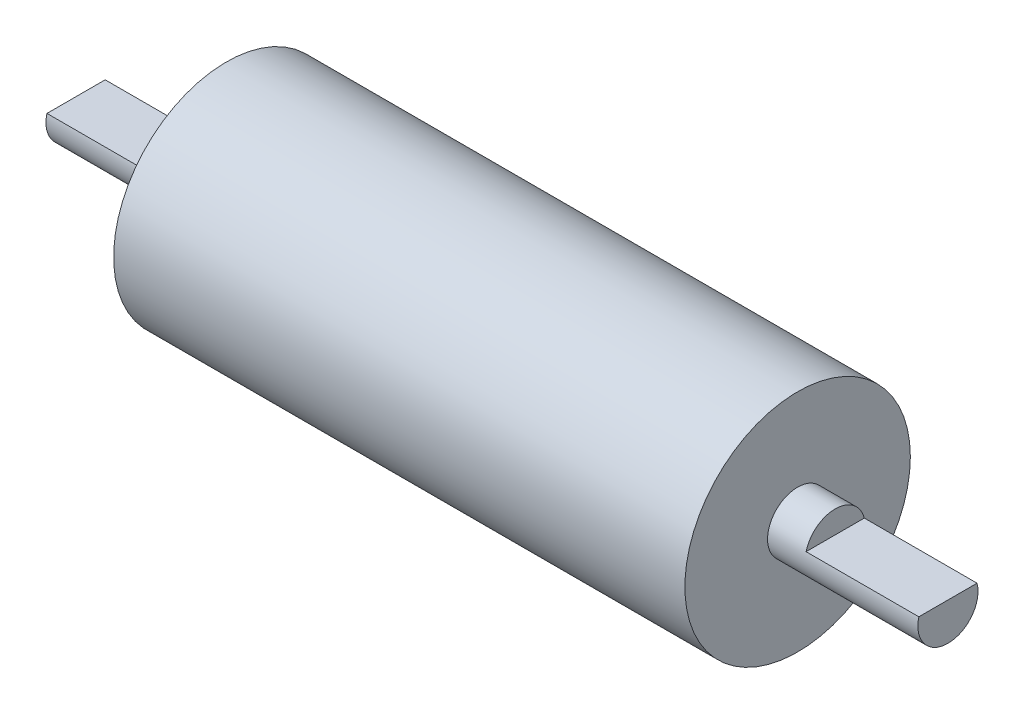
ISO-10303-21;
HEADER;
FILE_DESCRIPTION(('STEP AP214'),'2;1');
FILE_NAME('part.step','',(''),(''),'','','');
FILE_SCHEMA(('AUTOMOTIVE_DESIGN { 1 0 10303 214 1 1 1 1 }'));
ENDSEC;
DATA;
#1=APPLICATION_CONTEXT('core data for automotive mechanical design processes');
#2=APPLICATION_PROTOCOL_DEFINITION('international standard','automotive_design',2000,#1);
#3=PRODUCT_CONTEXT('',#1,'mechanical');
#4=PRODUCT('Part','Part','',(#3));
#5=PRODUCT_RELATED_PRODUCT_CATEGORY('part','',(#4));
#6=PRODUCT_DEFINITION_FORMATION('','',#4);
#7=PRODUCT_DEFINITION_CONTEXT('part definition',#1,'design');
#8=PRODUCT_DEFINITION('design','',#6,#7);
#9=PRODUCT_DEFINITION_SHAPE('','',#8);
#10=(LENGTH_UNIT() NAMED_UNIT(*) SI_UNIT(.MILLI.,.METRE.));
#11=(NAMED_UNIT(*) PLANE_ANGLE_UNIT() SI_UNIT($,.RADIAN.));
#12=(NAMED_UNIT(*) SI_UNIT($,.STERADIAN.) SOLID_ANGLE_UNIT());
#13=UNCERTAINTY_MEASURE_WITH_UNIT(LENGTH_MEASURE(1.E-05),#10,'distance_accuracy_value','');
#14=(GEOMETRIC_REPRESENTATION_CONTEXT(3) GLOBAL_UNCERTAINTY_ASSIGNED_CONTEXT((#13)) GLOBAL_UNIT_ASSIGNED_CONTEXT((#10,
#11,#12)) REPRESENTATION_CONTEXT('',''));
#15=CARTESIAN_POINT('',(0.,0.,0.));
#16=DIRECTION('',(0.,0.,1.));
#17=DIRECTION('',(1.,0.,0.));
#18=AXIS2_PLACEMENT_3D('',#15,#16,#17);
#19=CARTESIAN_POINT('',(20.,0.,0.));
#20=DIRECTION('',(-1.,0.,0.));
#21=DIRECTION('',(0.,0.,1.));
#22=AXIS2_PLACEMENT_3D('',#19,#20,#21);
#23=CYLINDRICAL_SURFACE('',#22,4.);
#24=CARTESIAN_POINT('',(20.,0.,0.));
#25=DIRECTION('',(1.,0.,0.));
#26=DIRECTION('',(0.,0.,-1.));
#27=AXIS2_PLACEMENT_3D('',#24,#25,#26);
#28=CIRCLE('',#27,4.);
#29=CARTESIAN_POINT('',(20.,0.,-4.));
#30=VERTEX_POINT('',#29);
#31=EDGE_CURVE('E105',#30,#30,#28,.T.);
#32=ORIENTED_EDGE('',*,*,#31,.F.);
#33=EDGE_LOOP('',(#32));
#34=FACE_BOUND('',#33,.T.);
#35=CARTESIAN_POINT('',(15.,0.,0.));
#36=DIRECTION('',(-1.,0.,0.));
#37=DIRECTION('',(0.,0.,1.));
#38=AXIS2_PLACEMENT_3D('',#35,#36,#37);
#39=CIRCLE('',#38,4.);
#40=CARTESIAN_POINT('',(15.,1.,3.87298334620742));
#41=VERTEX_POINT('',#40);
#42=CARTESIAN_POINT('',(15.,1.,-3.87298334620742));
#43=VERTEX_POINT('',#42);
#44=EDGE_CURVE('E83',#41,#43,#39,.T.);
#45=ORIENTED_EDGE('',*,*,#44,.F.);
#46=DIRECTION('',(-1.,0.,0.));
#47=VECTOR('',#46,1.);
#48=CARTESIAN_POINT('',(20.,1.,3.87298334620742));
#49=LINE('',#48,#47);
#50=CARTESIAN_POINT('',(0.,1.,3.87298334620741));
#51=VERTEX_POINT('',#50);
#52=EDGE_CURVE('E92',#41,#51,#49,.T.);
#53=ORIENTED_EDGE('',*,*,#52,.T.);
#54=CARTESIAN_POINT('',(0.,0.,0.));
#55=DIRECTION('',(1.,0.,0.));
#56=DIRECTION('',(0.,0.,-1.));
#57=AXIS2_PLACEMENT_3D('',#54,#55,#56);
#58=CIRCLE('',#57,4.);
#59=CARTESIAN_POINT('',(0.,1.,-3.87298334620742));
#60=VERTEX_POINT('',#59);
#61=EDGE_CURVE('E107',#51,#60,#58,.T.);
#62=ORIENTED_EDGE('',*,*,#61,.T.);
#63=DIRECTION('',(-1.,0.,0.));
#64=VECTOR('',#63,1.);
#65=CARTESIAN_POINT('',(20.,1.,-3.87298334620742));
#66=LINE('',#65,#64);
#67=EDGE_CURVE('E59',#60,#43,#66,.F.);
#68=ORIENTED_EDGE('',*,*,#67,.T.);
#69=EDGE_LOOP('',(#45,#53,#62,#68));
#70=FACE_BOUND('',#69,.T.);
#71=ADVANCED_FACE('F37',(#34,#70),#23,.T.);
#72=CARTESIAN_POINT('',(0.,0.,0.));
#73=DIRECTION('',(1.,0.,0.));
#74=DIRECTION('',(0.,0.,-1.));
#75=AXIS2_PLACEMENT_3D('',#72,#73,#74);
#76=PLANE('',#75);
#77=ORIENTED_EDGE('',*,*,#61,.F.);
#78=DIRECTION('',(0.,0.,-1.));
#79=VECTOR('',#78,1.);
#80=CARTESIAN_POINT('',(0.,1.,0.));
#81=LINE('',#80,#79);
#82=EDGE_CURVE('E104',#51,#60,#81,.T.);
#83=ORIENTED_EDGE('',*,*,#82,.T.);
#84=EDGE_LOOP('',(#77,#83));
#85=FACE_BOUND('',#84,.T.);
#86=ADVANCED_FACE('F136',(#85),#76,.F.);
#87=CARTESIAN_POINT('',(96.,0.,0.));
#88=DIRECTION('',(-1.,0.,0.));
#89=DIRECTION('',(0.,0.,1.));
#90=AXIS2_PLACEMENT_3D('',#87,#88,#89);
#91=CYLINDRICAL_SURFACE('',#90,15.);
#92=CARTESIAN_POINT('',(96.,0.,0.));
#93=DIRECTION('',(1.,0.,0.));
#94=DIRECTION('',(0.,0.,-1.));
#95=AXIS2_PLACEMENT_3D('',#92,#93,#94);
#96=CIRCLE('',#95,15.);
#97=CARTESIAN_POINT('',(96.,0.,-15.));
#98=VERTEX_POINT('',#97);
#99=EDGE_CURVE('E95',#98,#98,#96,.T.);
#100=ORIENTED_EDGE('',*,*,#99,.F.);
#101=EDGE_LOOP('',(#100));
#102=FACE_BOUND('',#101,.T.);
#103=CARTESIAN_POINT('',(20.,0.,0.));
#104=DIRECTION('',(1.,0.,0.));
#105=DIRECTION('',(0.,0.,-1.));
#106=AXIS2_PLACEMENT_3D('',#103,#104,#105);
#107=CIRCLE('',#106,15.);
#108=CARTESIAN_POINT('',(20.,0.,-15.));
#109=VERTEX_POINT('',#108);
#110=EDGE_CURVE('E91',#109,#109,#107,.T.);
#111=ORIENTED_EDGE('',*,*,#110,.T.);
#112=EDGE_LOOP('',(#111));
#113=FACE_BOUND('',#112,.T.);
#114=ADVANCED_FACE('F141',(#102,#113),#91,.T.);
#115=CARTESIAN_POINT('',(96.,0.,0.));
#116=DIRECTION('',(1.,0.,0.));
#117=DIRECTION('',(0.,0.,-1.));
#118=AXIS2_PLACEMENT_3D('',#115,#116,#117);
#119=PLANE('',#118);
#120=CARTESIAN_POINT('',(96.,0.,0.));
#121=DIRECTION('',(1.,0.,0.));
#122=DIRECTION('',(0.,0.,-1.));
#123=AXIS2_PLACEMENT_3D('',#120,#121,#122);
#124=CIRCLE('',#123,4.);
#125=CARTESIAN_POINT('',(96.,0.,-4.));
#126=VERTEX_POINT('',#125);
#127=EDGE_CURVE('E101',#126,#126,#124,.T.);
#128=ORIENTED_EDGE('',*,*,#127,.F.);
#129=EDGE_LOOP('',(#128));
#130=FACE_BOUND('',#129,.T.);
#131=ORIENTED_EDGE('',*,*,#99,.T.);
#132=EDGE_LOOP('',(#131));
#133=FACE_BOUND('',#132,.T.);
#134=ADVANCED_FACE('F148',(#130,#133),#119,.T.);
#135=CARTESIAN_POINT('',(20.,0.,0.));
#136=DIRECTION('',(1.,0.,0.));
#137=DIRECTION('',(0.,0.,-1.));
#138=AXIS2_PLACEMENT_3D('',#135,#136,#137);
#139=PLANE('',#138);
#140=ORIENTED_EDGE('',*,*,#31,.T.);
#141=EDGE_LOOP('',(#140));
#142=FACE_BOUND('',#141,.T.);
#143=ORIENTED_EDGE('',*,*,#110,.F.);
#144=EDGE_LOOP('',(#143));
#145=FACE_BOUND('',#144,.T.);
#146=ADVANCED_FACE('F145',(#142,#145),#139,.F.);
#147=CARTESIAN_POINT('',(116.,0.,0.));
#148=DIRECTION('',(-1.,0.,0.));
#149=DIRECTION('',(0.,0.,1.));
#150=AXIS2_PLACEMENT_3D('',#147,#148,#149);
#151=CYLINDRICAL_SURFACE('',#150,4.);
#152=CARTESIAN_POINT('',(116.,0.,0.));
#153=DIRECTION('',(1.,0.,0.));
#154=DIRECTION('',(0.,0.,-1.));
#155=AXIS2_PLACEMENT_3D('',#152,#153,#154);
#156=CIRCLE('',#155,4.);
#157=CARTESIAN_POINT('',(116.,1.,3.87298334620742));
#158=VERTEX_POINT('',#157);
#159=CARTESIAN_POINT('',(116.,1.,-3.87298334620742));
#160=VERTEX_POINT('',#159);
#161=EDGE_CURVE('E87',#158,#160,#156,.T.);
#162=ORIENTED_EDGE('',*,*,#161,.F.);
#163=DIRECTION('',(-1.,0.,0.));
#164=VECTOR('',#163,1.);
#165=CARTESIAN_POINT('',(116.,1.,3.87298334620742));
#166=LINE('',#165,#164);
#167=CARTESIAN_POINT('',(101.,1.,3.87298334620742));
#168=VERTEX_POINT('',#167);
#169=EDGE_CURVE('E51',#158,#168,#166,.T.);
#170=ORIENTED_EDGE('',*,*,#169,.T.);
#171=CARTESIAN_POINT('',(101.,0.,0.));
#172=DIRECTION('',(1.,0.,0.));
#173=DIRECTION('',(0.,0.,-1.));
#174=AXIS2_PLACEMENT_3D('',#171,#172,#173);
#175=CIRCLE('',#174,4.);
#176=CARTESIAN_POINT('',(101.,1.,-3.87298334620742));
#177=VERTEX_POINT('',#176);
#178=EDGE_CURVE('E11',#177,#168,#175,.T.);
#179=ORIENTED_EDGE('',*,*,#178,.F.);
#180=DIRECTION('',(-1.,0.,0.));
#181=VECTOR('',#180,1.);
#182=CARTESIAN_POINT('',(116.,1.,-3.87298334620742));
#183=LINE('',#182,#181);
#184=EDGE_CURVE('E78',#177,#160,#183,.F.);
#185=ORIENTED_EDGE('',*,*,#184,.T.);
#186=EDGE_LOOP('',(#162,#170,#179,#185));
#187=FACE_BOUND('',#186,.T.);
#188=ORIENTED_EDGE('',*,*,#127,.T.);
#189=EDGE_LOOP('',(#188));
#190=FACE_BOUND('',#189,.T.);
#191=ADVANCED_FACE('F85',(#187,#190),#151,.T.);
#192=CARTESIAN_POINT('',(116.,0.,0.));
#193=DIRECTION('',(1.,0.,0.));
#194=DIRECTION('',(0.,0.,-1.));
#195=AXIS2_PLACEMENT_3D('',#192,#193,#194);
#196=PLANE('',#195);
#197=DIRECTION('',(0.,0.,-1.));
#198=VECTOR('',#197,1.);
#199=CARTESIAN_POINT('',(116.,1.,0.));
#200=LINE('',#199,#198);
#201=EDGE_CURVE('E44',#158,#160,#200,.T.);
#202=ORIENTED_EDGE('',*,*,#201,.F.);
#203=ORIENTED_EDGE('',*,*,#161,.T.);
#204=EDGE_LOOP('',(#202,#203));
#205=FACE_BOUND('',#204,.T.);
#206=ADVANCED_FACE('F90',(#205),#196,.T.);
#207=CARTESIAN_POINT('',(15.,0.,0.));
#208=DIRECTION('',(-1.,0.,0.));
#209=DIRECTION('',(0.,0.,1.));
#210=AXIS2_PLACEMENT_3D('',#207,#208,#209);
#211=PLANE('',#210);
#212=DIRECTION('',(0.,0.,1.));
#213=VECTOR('',#212,1.);
#214=CARTESIAN_POINT('',(15.,1.,-7.62968902742798));
#215=LINE('',#214,#213);
#216=EDGE_CURVE('E117',#43,#41,#215,.T.);
#217=ORIENTED_EDGE('',*,*,#216,.T.);
#218=ORIENTED_EDGE('',*,*,#44,.T.);
#219=EDGE_LOOP('',(#217,#218));
#220=FACE_BOUND('',#219,.T.);
#221=ADVANCED_FACE('F116',(#220),#211,.T.);
#222=CARTESIAN_POINT('',(15.,1.,-7.62968902742798));
#223=DIRECTION('',(0.,-1.,0.));
#224=DIRECTION('',(0.,0.,-1.));
#225=AXIS2_PLACEMENT_3D('',#222,#223,#224);
#226=PLANE('',#225);
#227=ORIENTED_EDGE('',*,*,#216,.F.);
#228=ORIENTED_EDGE('',*,*,#67,.F.);
#229=ORIENTED_EDGE('',*,*,#82,.F.);
#230=ORIENTED_EDGE('',*,*,#52,.F.);
#231=EDGE_LOOP('',(#227,#228,#229,#230));
#232=FACE_BOUND('',#231,.T.);
#233=ADVANCED_FACE('F120',(#232),#226,.F.);
#234=CARTESIAN_POINT('',(101.,0.,0.));
#235=DIRECTION('',(1.,0.,0.));
#236=DIRECTION('',(0.,0.,-1.));
#237=AXIS2_PLACEMENT_3D('',#234,#235,#236);
#238=PLANE('',#237);
#239=DIRECTION('',(0.,0.,-1.));
#240=VECTOR('',#239,1.);
#241=CARTESIAN_POINT('',(101.,1.,6.98276782128457));
#242=LINE('',#241,#240);
#243=EDGE_CURVE('E88',#168,#177,#242,.T.);
#244=ORIENTED_EDGE('',*,*,#243,.T.);
#245=ORIENTED_EDGE('',*,*,#178,.T.);
#246=EDGE_LOOP('',(#244,#245));
#247=FACE_BOUND('',#246,.T.);
#248=ADVANCED_FACE('F126',(#247),#238,.T.);
#249=CARTESIAN_POINT('',(101.,1.,6.98276782128457));
#250=DIRECTION('',(0.,-1.,0.));
#251=DIRECTION('',(0.,0.,-1.));
#252=AXIS2_PLACEMENT_3D('',#249,#250,#251);
#253=PLANE('',#252);
#254=ORIENTED_EDGE('',*,*,#201,.T.);
#255=ORIENTED_EDGE('',*,*,#184,.F.);
#256=ORIENTED_EDGE('',*,*,#243,.F.);
#257=ORIENTED_EDGE('',*,*,#169,.F.);
#258=EDGE_LOOP('',(#254,#255,#256,#257));
#259=FACE_BOUND('',#258,.T.);
#260=ADVANCED_FACE('F77',(#259),#253,.F.);
#261=CLOSED_SHELL('',(#71,#86,#114,#134,#146,#191,#206,#221,#233,#248,#260));
#262=MANIFOLD_SOLID_BREP('B2',#261);
#263=ADVANCED_BREP_SHAPE_REPRESENTATION('',(#18,#262),#14);
#264=SHAPE_DEFINITION_REPRESENTATION(#9,#263);
ENDSEC;
END-ISO-10303-21;
